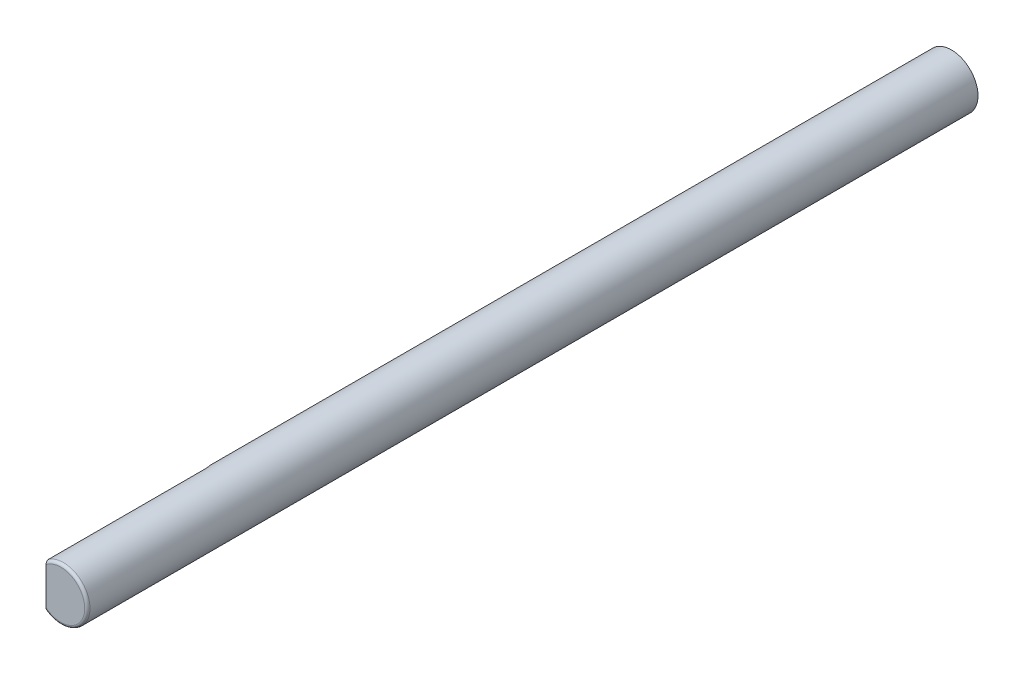
ISO-10303-21;
HEADER;
FILE_DESCRIPTION(('STEP AP214'),'2;1');
FILE_NAME('part.step','',(''),(''),'','','');
FILE_SCHEMA(('AUTOMOTIVE_DESIGN { 1 0 10303 214 1 1 1 1 }'));
ENDSEC;
DATA;
#1=APPLICATION_CONTEXT('core data for automotive mechanical design processes');
#2=APPLICATION_PROTOCOL_DEFINITION('international standard','automotive_design',2000,#1);
#3=PRODUCT_CONTEXT('',#1,'mechanical');
#4=PRODUCT('Part','Part','',(#3));
#5=PRODUCT_RELATED_PRODUCT_CATEGORY('part','',(#4));
#6=PRODUCT_DEFINITION_FORMATION('','',#4);
#7=PRODUCT_DEFINITION_CONTEXT('part definition',#1,'design');
#8=PRODUCT_DEFINITION('design','',#6,#7);
#9=PRODUCT_DEFINITION_SHAPE('','',#8);
#10=(LENGTH_UNIT() NAMED_UNIT(*) SI_UNIT(.MILLI.,.METRE.));
#11=(NAMED_UNIT(*) PLANE_ANGLE_UNIT() SI_UNIT($,.RADIAN.));
#12=(NAMED_UNIT(*) SI_UNIT($,.STERADIAN.) SOLID_ANGLE_UNIT());
#13=UNCERTAINTY_MEASURE_WITH_UNIT(LENGTH_MEASURE(1.E-05),#10,'distance_accuracy_value','');
#14=(GEOMETRIC_REPRESENTATION_CONTEXT(3) GLOBAL_UNCERTAINTY_ASSIGNED_CONTEXT((#13)) GLOBAL_UNIT_ASSIGNED_CONTEXT((#10,
#11,#12)) REPRESENTATION_CONTEXT('',''));
#15=CARTESIAN_POINT('',(0.,0.,0.));
#16=DIRECTION('',(0.,0.,1.));
#17=DIRECTION('',(1.,0.,0.));
#18=AXIS2_PLACEMENT_3D('',#15,#16,#17);
#19=CARTESIAN_POINT('',(0.,0.,84.));
#20=DIRECTION('',(0.,0.,-1.));
#21=DIRECTION('',(-1.,0.,0.));
#22=AXIS2_PLACEMENT_3D('',#19,#20,#21);
#23=CYLINDRICAL_SURFACE('',#22,2.5);
#24=CARTESIAN_POINT('',(0.,0.,0.));
#25=DIRECTION('',(0.,0.,1.));
#26=DIRECTION('',(1.,0.,0.));
#27=AXIS2_PLACEMENT_3D('',#24,#25,#26);
#28=CIRCLE('',#27,2.5);
#29=CARTESIAN_POINT('',(2.5,0.,0.));
#30=VERTEX_POINT('',#29);
#31=EDGE_CURVE('E67',#30,#30,#28,.T.);
#32=ORIENTED_EDGE('',*,*,#31,.T.);
#33=EDGE_LOOP('',(#32));
#34=FACE_BOUND('',#33,.T.);
#35=DIRECTION('',(0.,0.,-1.));
#36=VECTOR('',#35,1.);
#37=CARTESIAN_POINT('',(-1.4,2.0712315177208,84.));
#38=LINE('',#37,#36);
#39=CARTESIAN_POINT('',(-1.4,2.07123151772333,83.750000000001));
#40=VERTEX_POINT('',#39);
#41=CARTESIAN_POINT('',(-1.4,2.0712315177208,69.));
#42=VERTEX_POINT('',#41);
#43=EDGE_CURVE('E63',#40,#42,#38,.T.);
#44=ORIENTED_EDGE('',*,*,#43,.F.);
#45=CARTESIAN_POINT('',(0.,0.,83.75));
#46=DIRECTION('',(0.,0.,1.));
#47=DIRECTION('',(1.,0.,0.));
#48=AXIS2_PLACEMENT_3D('',#45,#46,#47);
#49=CIRCLE('',#48,2.5);
#50=CARTESIAN_POINT('',(-1.4,-2.07123151776407,83.7499999999845));
#51=VERTEX_POINT('',#50);
#52=EDGE_CURVE('E66',#40,#51,#49,.F.);
#53=ORIENTED_EDGE('',*,*,#52,.T.);
#54=DIRECTION('',(0.,0.,-1.));
#55=VECTOR('',#54,1.);
#56=CARTESIAN_POINT('',(-1.4,-2.0712315177208,84.));
#57=LINE('',#56,#55);
#58=CARTESIAN_POINT('',(-1.4,-2.0712315177208,69.));
#59=VERTEX_POINT('',#58);
#60=EDGE_CURVE('E43',#59,#51,#57,.F.);
#61=ORIENTED_EDGE('',*,*,#60,.F.);
#62=CARTESIAN_POINT('',(-1.4,2.0712315177208,69.));
#63=CARTESIAN_POINT('',(-1.39999849760734,2.071230026212,68.9761336321505));
#64=CARTESIAN_POINT('',(-1.4008551488557,2.07065376805563,68.9522791906795));
#65=CARTESIAN_POINT('',(-1.40426145306465,2.06834621400237,68.9047514836602));
#66=CARTESIAN_POINT('',(-1.40681083767712,2.06661510118376,68.8810781899964));
#67=CARTESIAN_POINT('',(-1.41693911021825,2.059697650857,68.8107243778242));
#68=CARTESIAN_POINT('',(-1.42699848417547,2.052787241238,68.7645353429884));
#69=CARTESIAN_POINT('',(-1.45316462908091,2.03434628246119,68.6749057138266));
#70=CARTESIAN_POINT('',(-1.46927177576742,2.0228154462408,68.6314652904634));
#71=CARTESIAN_POINT('',(-1.50660792862266,1.99516165480955,68.5484218227556));
#72=CARTESIAN_POINT('',(-1.52783743401127,1.97903825198415,68.5088191529622));
#73=CARTESIAN_POINT('',(-1.57474464069025,1.94192906346373,68.4334600120504));
#74=CARTESIAN_POINT('',(-1.60051004822204,1.92084396604998,68.3978075175362));
#75=CARTESIAN_POINT('',(-1.65476045746043,1.87431267599082,68.331833953011));
#76=CARTESIAN_POINT('',(-1.68324681285336,1.84886430753645,68.3015155582839));
#77=CARTESIAN_POINT('',(-1.75188020240658,1.78432861963461,68.2365263708325));
#78=CARTESIAN_POINT('',(-1.79259801470348,1.74359569054775,68.2040886147845));
#79=CARTESIAN_POINT('',(-1.87373293961663,1.6561127393503,68.1482480300484));
#80=CARTESIAN_POINT('',(-1.9141494387131,1.60935281202574,68.1248603339338));
#81=CARTESIAN_POINT('',(-2.00868395747665,1.49097224184156,68.0776682724385));
#82=CARTESIAN_POINT('',(-2.06167245566697,1.41698665412497,68.0575792205504));
#83=CARTESIAN_POINT('',(-2.15998693685785,1.26211622920362,68.0278654267815));
#84=CARTESIAN_POINT('',(-2.20529362558644,1.18121476547613,68.0182667137365));
#85=CARTESIAN_POINT('',(-2.27518682931121,1.03824044791976,68.0073850582776));
#86=CARTESIAN_POINT('',(-2.3020034371994,0.977346431713888,68.0045145279523));
#87=CARTESIAN_POINT('',(-2.35072392208404,0.853535355661818,68.0009151495136));
#88=CARTESIAN_POINT('',(-2.37262582697523,0.790617495251964,68.0001871597154));
#89=CARTESIAN_POINT('',(-2.41133776392088,0.663236816952995,67.9998771329302));
#90=CARTESIAN_POINT('',(-2.42814758959221,0.598773936558106,68.0002951423839));
#91=CARTESIAN_POINT('',(-2.45656795841086,0.46872501671509,68.0014998441395));
#92=CARTESIAN_POINT('',(-2.46817917835834,0.403139124625449,68.0022864884219));
#93=CARTESIAN_POINT('',(-2.48629500567455,0.270052532778325,68.0036879932044));
#94=CARTESIAN_POINT('',(-2.49270333079678,0.202538665641398,68.0042994849443));
#95=CARTESIAN_POINT('',(-2.50001501608926,0.0672084542153276,68.0050072591245));
#96=CARTESIAN_POINT('',(-2.50091820098299,-0.000607899635807313,68.0051035251607));
#97=CARTESIAN_POINT('',(-2.49721126667906,-0.136146726712124,68.0047344925744));
#98=CARTESIAN_POINT('',(-2.4925963955963,-0.203869068669604,68.0042687099395));
#99=CARTESIAN_POINT('',(-2.47787728559477,-0.338709390708671,68.0030098533241));
#100=CARTESIAN_POINT('',(-2.46777310584157,-0.405827377296271,68.0022167828711));
#101=CARTESIAN_POINT('',(-2.44166968941243,-0.541472802830017,68.0007798339144));
#102=CARTESIAN_POINT('',(-2.42546739083533,-0.60996134772772,68.000142511919));
#103=CARTESIAN_POINT('',(-2.38734056394478,-0.745353962722344,67.9998984993942));
#104=CARTESIAN_POINT('',(-2.36541438705108,-0.812257570263471,68.0002921060865));
#105=CARTESIAN_POINT('',(-2.31606035856292,-0.943815957062459,68.0032230416401));
#106=CARTESIAN_POINT('',(-2.288643687182,-1.00847499794695,68.0057560472638));
#107=CARTESIAN_POINT('',(-2.22858646003884,-1.13503422834247,68.0143345571866));
#108=CARTESIAN_POINT('',(-2.19595026735371,-1.19693666736589,68.0203771387836));
#109=CARTESIAN_POINT('',(-2.122180192478,-1.32373849224061,68.0385362468503));
#110=CARTESIAN_POINT('',(-2.08051081784005,-1.38825056412552,68.051233161495));
#111=CARTESIAN_POINT('',(-1.99267532777597,-1.51160369346608,68.0855058136959));
#112=CARTESIAN_POINT('',(-1.94651692208629,-1.57045414037392,68.1070665266446));
#113=CARTESIAN_POINT('',(-1.86164401332915,-1.66962592428561,68.156161196175));
#114=CARTESIAN_POINT('',(-1.82330783215959,-1.71128948965175,68.181610704844));
#115=CARTESIAN_POINT('',(-1.74725608089452,-1.78886384518241,68.2408954194401));
#116=CARTESIAN_POINT('',(-1.70953987270419,-1.82478093209195,68.2747213418162));
#117=CARTESIAN_POINT('',(-1.64313851742848,-1.88461329310625,68.3449408068653));
#118=CARTESIAN_POINT('',(-1.61398037683587,-1.90953027717284,68.3800297594055));
#119=CARTESIAN_POINT('',(-1.55957119801496,-1.9542205433493,68.4560692469223));
#120=CARTESIAN_POINT('',(-1.53431944251109,-1.97399477020797,68.4970187031508));
#121=CARTESIAN_POINT('',(-1.48925213542689,-2.00821755195406,68.5841221584053));
#122=CARTESIAN_POINT('',(-1.46946172497381,-2.0226415787411,68.6302988910753));
#123=CARTESIAN_POINT('',(-1.43683617139669,-2.04594939702088,68.7263564470342));
#124=CARTESIAN_POINT('',(-1.42399490317059,-2.05483806852325,68.7762339641375));
#125=CARTESIAN_POINT('',(-1.41007156402517,-2.06439648102775,68.85550440898));
#126=CARTESIAN_POINT('',(-1.40630111414533,-2.06696205385486,68.8842332109407));
#127=CARTESIAN_POINT('',(-1.40126460084139,-2.0703770393523,68.9419691555056));
#128=CARTESIAN_POINT('',(-1.39999499231638,-2.07122888138113,68.970975845446));
#129=CARTESIAN_POINT('',(-1.4,-2.0712315177208,69.));
#130=B_SPLINE_CURVE_WITH_KNOTS('',3,(#62,#63,#64,#65,#66,#67,#68,#69,#70,#71,#72,#73,#74,#75,
#76,#77,#78,#79,#80,#81,#82,#83,#84,#85,#86,#87,#88,#89,#90,#91,#92,#93,#94,#95,#96,#97,#98,#99,
#100,#101,#102,#103,#104,#105,#106,#107,#108,#109,#110,#111,#112,#113,#114,#115,#116,#117,#118,
#119,#120,#121,#122,#123,#124,#125,#126,#127,#128,#129),.UNSPECIFIED.,.F.,.F.,(4,2,2,2,2,2,2,2,
2,2,2,2,2,2,2,2,2,2,2,2,2,2,2,2,2,2,2,2,2,2,2,2,2,4),(0.,0.0715532695161541,0.143095198438069,
0.285662258223454,0.428238176934206,0.57082799656538,0.716559703502077,0.862364294176844,
1.05956506247232,1.25709415914806,1.53513154445075,1.81385724627246,2.01341483696889,
2.2130523608,2.41269797490278,2.61231758982236,2.81555207530803,3.01879303148233,
3.2222091351427,3.42562304636158,3.63651498052536,3.84746772251548,4.05799519420227,
4.2683475938554,4.50119263591325,4.73364461005268,4.91917153753062,5.10449375925448,
5.25978134170542,5.41504037691086,5.57100265153675,5.72682723330395,5.81394908507755,
5.90094734697911),.UNSPECIFIED.);
#131=EDGE_CURVE('E11',#42,#59,#130,.T.);
#132=ORIENTED_EDGE('',*,*,#131,.F.);
#133=EDGE_LOOP('',(#44,#53,#61,#132));
#134=FACE_BOUND('',#133,.T.);
#135=ADVANCED_FACE('F17',(#34,#134),#23,.T.);
#136=CARTESIAN_POINT('',(0.,0.,84.));
#137=DIRECTION('',(0.,0.,1.));
#138=DIRECTION('',(1.,0.,0.));
#139=AXIS2_PLACEMENT_3D('',#136,#137,#138);
#140=PLANE('',#139);
#141=CARTESIAN_POINT('',(0.,0.,84.));
#142=DIRECTION('',(0.,0.,1.));
#143=DIRECTION('',(1.,0.,0.));
#144=AXIS2_PLACEMENT_3D('',#141,#142,#143);
#145=CIRCLE('',#144,2.25);
#146=CARTESIAN_POINT('',(-1.4,-1.76139149538085,84.));
#147=VERTEX_POINT('',#146);
#148=CARTESIAN_POINT('',(-1.4,1.76139149538085,84.));
#149=VERTEX_POINT('',#148);
#150=EDGE_CURVE('E62',#147,#149,#145,.T.);
#151=ORIENTED_EDGE('',*,*,#150,.T.);
#152=DIRECTION('',(0.,-1.,0.));
#153=VECTOR('',#152,1.);
#154=CARTESIAN_POINT('',(-1.4,3.,84.));
#155=LINE('',#154,#153);
#156=EDGE_CURVE('E37',#149,#147,#155,.T.);
#157=ORIENTED_EDGE('',*,*,#156,.T.);
#158=EDGE_LOOP('',(#151,#157));
#159=FACE_BOUND('',#158,.T.);
#160=ADVANCED_FACE('F61',(#159),#140,.T.);
#161=CARTESIAN_POINT('',(0.,0.,83.75));
#162=DIRECTION('',(0.,0.,1.));
#163=DIRECTION('',(1.,0.,0.));
#164=AXIS2_PLACEMENT_3D('',#161,#162,#163);
#165=TOROIDAL_SURFACE('',#164,2.25,0.25);
#166=ORIENTED_EDGE('',*,*,#150,.F.);
#167=CARTESIAN_POINT('',(-1.4,-2.06751683308907,83.7891010855561));
#168=CARTESIAN_POINT('',(-1.4,-2.06974663483901,83.777437227729));
#169=CARTESIAN_POINT('',(-1.4,-2.07098619314722,83.7655748201244));
#170=CARTESIAN_POINT('',(-1.4,-2.07141107098375,83.7418068058583));
#171=CARTESIAN_POINT('',(-1.4,-2.07059465921011,83.7299011712248));
#172=CARTESIAN_POINT('',(-1.4,-2.0669532950407,83.7064217157143));
#173=CARTESIAN_POINT('',(-1.4,-2.06413145538078,83.6948474094905));
#174=CARTESIAN_POINT('',(-1.4,-2.0566281091433,83.6723235623699));
#175=CARTESIAN_POINT('',(-1.4,-2.05194655243663,83.6613740383232));
#176=CARTESIAN_POINT('',(-1.4,-2.04080930293354,83.6400952407117));
#177=CARTESIAN_POINT('',(-1.4,-2.03431462231287,83.6297865031043));
#178=CARTESIAN_POINT('',(-1.4,-2.01986653934911,83.6102529605718));
#179=CARTESIAN_POINT('',(-1.4,-2.01191266429024,83.6010285085018));
#180=CARTESIAN_POINT('',(-1.4,-1.9937541034437,83.5827007751038));
#181=CARTESIAN_POINT('',(-1.4,-1.98339275579103,83.5737531623327));
#182=CARTESIAN_POINT('',(-1.4,-1.96150965793689,83.5574182538762));
#183=CARTESIAN_POINT('',(-1.4,-1.94998725736353,83.5500318399631));
#184=CARTESIAN_POINT('',(-1.4,-1.92398558481914,83.5356647661989));
#185=CARTESIAN_POINT('',(-1.4,-1.90934196489993,83.5289819633223));
#186=CARTESIAN_POINT('',(-1.4,-1.87927037468484,83.5177232068366));
#187=CARTESIAN_POINT('',(-1.4,-1.86384195411895,83.5131484782001));
#188=CARTESIAN_POINT('',(-1.4,-1.82950833387279,83.50534262039));
#189=CARTESIAN_POINT('',(-1.4,-1.81050556367343,83.5025396438597));
#190=CARTESIAN_POINT('',(-1.4,-1.77229105082405,83.4996869685397));
#191=CARTESIAN_POINT('',(-1.4,-1.75307914527016,83.4996395965652));
#192=CARTESIAN_POINT('',(-1.4,-1.7117902214243,83.5024012227717));
#193=CARTESIAN_POINT('',(-1.4,-1.6897427077554,83.5056650155171));
#194=CARTESIAN_POINT('',(-1.4,-1.64644198331438,83.5156791685163));
#195=CARTESIAN_POINT('',(-1.4,-1.62518892017161,83.522430173364));
#196=CARTESIAN_POINT('',(-1.4,-1.58737690923002,83.5380971283731));
#197=CARTESIAN_POINT('',(-1.4,-1.57060656277229,83.5465031021878));
#198=CARTESIAN_POINT('',(-1.4,-1.53861329491591,83.5658770933205));
#199=CARTESIAN_POINT('',(-1.4,-1.52338802602703,83.57684113784));
#200=CARTESIAN_POINT('',(-1.4,-1.49897049299346,83.5981346111587));
#201=CARTESIAN_POINT('',(-1.4,-1.48925035998301,83.6078580040598));
#202=CARTESIAN_POINT('',(-1.4,-1.4714584706523,83.6287166431668));
#203=CARTESIAN_POINT('',(-1.4,-1.46338439491053,83.6398498664212));
#204=CARTESIAN_POINT('',(-1.4,-1.4507334316404,83.6611586976973));
#205=CARTESIAN_POINT('',(-1.4,-1.44578318431217,83.6711114792115));
#206=CARTESIAN_POINT('',(-1.4,-1.43759584646562,83.6917020970445));
#207=CARTESIAN_POINT('',(-1.4,-1.4343574653913,83.7023394104964));
#208=CARTESIAN_POINT('',(-1.4,-1.4298290781451,83.7240925513704));
#209=CARTESIAN_POINT('',(-1.4,-1.42855045587284,83.7352107917521));
#210=CARTESIAN_POINT('',(-1.4,-1.42809553098984,83.7574896787589));
#211=CARTESIAN_POINT('',(-1.4,-1.42891878834498,83.7686503160196));
#212=CARTESIAN_POINT('',(-1.4,-1.43241916211485,83.7896145408629));
#213=CARTESIAN_POINT('',(-1.4,-1.43491906611748,83.7994486210256));
#214=CARTESIAN_POINT('',(-1.4,-1.44141428492636,83.8186058830384));
#215=CARTESIAN_POINT('',(-1.4,-1.44541017890801,83.8279288654112));
#216=CARTESIAN_POINT('',(-1.4,-1.45621885548422,83.8488975046023));
#217=CARTESIAN_POINT('',(-1.4,-1.46352634537145,83.8602879919474));
#218=CARTESIAN_POINT('',(-1.4,-1.47989400527921,83.8817327842286));
#219=CARTESIAN_POINT('',(-1.4,-1.48895766474658,83.8917843605605));
#220=CARTESIAN_POINT('',(-1.4,-1.51172684638418,83.9137057431346));
#221=CARTESIAN_POINT('',(-1.4,-1.52596084061072,83.9250252168777));
#222=CARTESIAN_POINT('',(-1.4,-1.55604364818145,83.9452346300285));
#223=CARTESIAN_POINT('',(-1.4,-1.57189399103952,83.9541222383772));
#224=CARTESIAN_POINT('',(-1.4,-1.60509205177313,83.9697301689048));
#225=CARTESIAN_POINT('',(-1.4,-1.62246678945902,83.9763926027679));
#226=CARTESIAN_POINT('',(-1.4,-1.65795648623812,83.9872847058436));
#227=CARTESIAN_POINT('',(-1.4,-1.6760715609739,83.9915139934249));
#228=CARTESIAN_POINT('',(-1.4,-1.71668463073393,83.9981790966882));
#229=CARTESIAN_POINT('',(-1.4,-1.73928135435023,84.0000272604717));
#230=CARTESIAN_POINT('',(-1.4,-1.78448376970429,83.9999721482763));
#231=CARTESIAN_POINT('',(-1.4,-1.80708946223592,83.998068372268));
#232=CARTESIAN_POINT('',(-1.4,-1.84821950148282,83.990900479456));
#233=CARTESIAN_POINT('',(-1.4,-1.86684068119384,83.9861928771534));
#234=CARTESIAN_POINT('',(-1.4,-1.90306492013531,83.9738000651801));
#235=CARTESIAN_POINT('',(-1.4,-1.92066925601977,83.9661186867872));
#236=CARTESIAN_POINT('',(-1.4,-1.95108276070406,83.9494011757541));
#237=CARTESIAN_POINT('',(-1.4,-1.96417540630331,83.9408812900778));
#238=CARTESIAN_POINT('',(-1.4,-1.98879972897973,83.9218099295069));
#239=CARTESIAN_POINT('',(-1.4,-2.00033247871237,83.9112598628762));
#240=CARTESIAN_POINT('',(-1.4,-2.01971362853195,83.889999748638));
#241=CARTESIAN_POINT('',(-1.4,-2.02785558157892,83.8795574753407));
#242=CARTESIAN_POINT('',(-1.4,-2.0422844443968,83.8574712871667));
#243=CARTESIAN_POINT('',(-1.4,-2.0485750115816,83.8458298036274));
#244=CARTESIAN_POINT('',(-1.4,-2.05686313303344,83.8265667315097));
#245=CARTESIAN_POINT('',(-1.4,-2.05956520863061,83.8192420974961));
#246=CARTESIAN_POINT('',(-1.4,-2.06415970755473,83.8043406035764));
#247=CARTESIAN_POINT('',(-1.4,-2.06605195845041,83.7967636903238));
#248=CARTESIAN_POINT('',(-1.4,-2.06751683308907,83.7891010855561));
#249=B_SPLINE_CURVE_WITH_KNOTS('',3,(#167,#168,#169,#170,#171,#172,#173,#174,#175,#176,#177,
#178,#179,#180,#181,#182,#183,#184,#185,#186,#187,#188,#189,#190,#191,#192,#193,#194,#195,#196,
#197,#198,#199,#200,#201,#202,#203,#204,#205,#206,#207,#208,#209,#210,#211,#212,#213,#214,#215,
#216,#217,#218,#219,#220,#221,#222,#223,#224,#225,#226,#227,#228,#229,#230,#231,#232,#233,#234,
#235,#236,#237,#238,#239,#240,#241,#242,#243,#244,#245,#246,#247,#248),.UNSPECIFIED.,.T.,.F.,(4,
2,2,2,2,2,2,2,2,2,2,2,2,2,2,2,2,2,2,2,2,2,2,2,2,2,2,2,2,2,2,2,2,2,2,2,2,2,2,2,4),(0.,
0.0355961807103801,0.0712223464592027,0.106793335293122,0.142365283016314,0.178770448703504,
0.215187428979943,0.256102062954481,0.297039744316028,0.345150289814807,0.393288756539711,
0.450693683664056,0.508147082446449,0.574724248706875,0.641313725831208,0.697391627920788,
0.753383011517215,0.794490689246709,0.835540036524267,0.868754193931766,0.901943275733764,
0.93532442614022,0.968698588686508,0.999007499009383,1.02932815563991,1.06970492159057,
1.11016275306152,1.16442907958132,1.21874724217939,1.27438481822114,1.33003111846337,
1.39774216865079,1.46546224345024,1.52285865260922,1.58018135961871,1.62686222808655,
1.67351083167207,1.71307288751942,1.7525562556671,1.77593629271712,1.79932130546876),.UNSPECIFIED.);
#250=EDGE_CURVE('E30',#147,#51,#249,.T.);
#251=ORIENTED_EDGE('',*,*,#250,.T.);
#252=ORIENTED_EDGE('',*,*,#52,.F.);
#253=CARTESIAN_POINT('',(-1.4,1.42993276071515,83.7742261251652));
#254=CARTESIAN_POINT('',(-1.4,1.4284797737069,83.7635492828199));
#255=CARTESIAN_POINT('',(-1.4,1.42798224116026,83.752730889155));
#256=CARTESIAN_POINT('',(-1.4,1.42895217107645,83.7311692769836));
#257=CARTESIAN_POINT('',(-1.4,1.43042317296387,83.7204262288915));
#258=CARTESIAN_POINT('',(-1.4,1.43519728667231,83.6994144021854));
#259=CARTESIAN_POINT('',(-1.4,1.43849176524819,83.6891436338747));
#260=CARTESIAN_POINT('',(-1.4,1.44666971777003,83.6692642515512));
#261=CARTESIAN_POINT('',(-1.4,1.45155370771529,83.6596558537912));
#262=CARTESIAN_POINT('',(-1.4,1.46444756291549,83.6382390395022));
#263=CARTESIAN_POINT('',(-1.4,1.47295744431321,83.6267322484986));
#264=CARTESIAN_POINT('',(-1.4,1.49172277952782,83.6052419199731));
#265=CARTESIAN_POINT('',(-1.4,1.50198172658524,83.5952615081257));
#266=CARTESIAN_POINT('',(-1.4,1.5275223101756,83.57368243797));
#267=CARTESIAN_POINT('',(-1.4,1.54332172700824,83.5626978240926));
#268=CARTESIAN_POINT('',(-1.4,1.5764636907251,83.5434107210859));
#269=CARTESIAN_POINT('',(-1.4,1.59380751652582,83.5351104817155));
#270=CARTESIAN_POINT('',(-1.4,1.62990007353498,83.5209669260947));
#271=CARTESIAN_POINT('',(-1.4,1.64867116870904,83.5151810264129));
#272=CARTESIAN_POINT('',(-1.4,1.68684132045745,83.5063189232525));
#273=CARTESIAN_POINT('',(-1.4,1.70624056049469,83.5032435189687));
#274=CARTESIAN_POINT('',(-1.4,1.74873438637282,83.4995536950047));
#275=CARTESIAN_POINT('',(-1.4,1.77187720679287,83.4994690666402));
#276=CARTESIAN_POINT('',(-1.4,1.81784027375452,83.5033042850002));
#277=CARTESIAN_POINT('',(-1.4,1.8406606502949,83.5072224683455));
#278=CARTESIAN_POINT('',(-1.4,1.88030824440976,83.5179758414875));
#279=CARTESIAN_POINT('',(-1.4,1.89735869050308,83.5239903626366));
#280=CARTESIAN_POINT('',(-1.4,1.93025269881234,83.5387117960323));
#281=CARTESIAN_POINT('',(-1.4,1.94609799374124,83.5474147481545));
#282=CARTESIAN_POINT('',(-1.4,1.97329805283162,83.5657532706061));
#283=CARTESIAN_POINT('',(-1.4,1.98495007952567,83.5749470568571));
#284=CARTESIAN_POINT('',(-1.4,2.00659791928444,83.5951300283886));
#285=CARTESIAN_POINT('',(-1.4,2.01659399192529,83.6061189317414));
#286=CARTESIAN_POINT('',(-1.4,2.03452337916375,83.6298236204108));
#287=CARTESIAN_POINT('',(-1.4,2.04243949530355,83.64255255701));
#288=CARTESIAN_POINT('',(-1.4,2.05560314677401,83.6693255902568));
#289=CARTESIAN_POINT('',(-1.4,2.06085347256681,83.6833682933797));
#290=CARTESIAN_POINT('',(-1.4,2.06777488493683,83.7101941879195));
#291=CARTESIAN_POINT('',(-1.4,2.06984728297949,83.7228744694489));
#292=CARTESIAN_POINT('',(-1.4,2.07161875211616,83.7483975931196));
#293=CARTESIAN_POINT('',(-1.4,2.0713191453306,83.7612403407195));
#294=CARTESIAN_POINT('',(-1.4,2.06849276478409,83.7855836680409));
#295=CARTESIAN_POINT('',(-1.4,2.06615414494294,83.7971067418848));
#296=CARTESIAN_POINT('',(-1.4,2.05962450786554,83.8196121664179));
#297=CARTESIAN_POINT('',(-1.4,2.05543347758694,83.8305945132994));
#298=CARTESIAN_POINT('',(-1.4,2.04525546888174,83.8520540796839));
#299=CARTESIAN_POINT('',(-1.4,2.03922285619763,83.8625095152223));
#300=CARTESIAN_POINT('',(-1.4,2.02565875048042,83.8823937703506));
#301=CARTESIAN_POINT('',(-1.4,2.01812673296544,83.8918222289203));
#302=CARTESIAN_POINT('',(-1.4,2.00089325345193,83.9105442717815));
#303=CARTESIAN_POINT('',(-1.4,1.99104234333876,83.9196998594455));
#304=CARTESIAN_POINT('',(-1.4,1.97014066575349,83.9365135536256));
#305=CARTESIAN_POINT('',(-1.4,1.95908926581928,83.9441708647857));
#306=CARTESIAN_POINT('',(-1.4,1.93412074607394,83.9591496788247));
#307=CARTESIAN_POINT('',(-1.4,1.92003619338562,83.9661916355392));
#308=CARTESIAN_POINT('',(-1.4,1.89102703340341,83.9782429473955));
#309=CARTESIAN_POINT('',(-1.4,1.87610193650406,83.9832511036366));
#310=CARTESIAN_POINT('',(-1.4,1.84280444408958,83.9920802029753));
#311=CARTESIAN_POINT('',(-1.4,1.82432193698389,83.9954864482576));
#312=CARTESIAN_POINT('',(-1.4,1.78705897675403,83.999632953357));
#313=CARTESIAN_POINT('',(-1.4,1.7682783040645,84.0003711473871));
#314=CARTESIAN_POINT('',(-1.4,1.72766042914337,83.9991943088168));
#315=CARTESIAN_POINT('',(-1.4,1.7058358179539,83.9968162703746));
#316=CARTESIAN_POINT('',(-1.4,1.66281719964284,83.9886666111979));
#317=CARTESIAN_POINT('',(-1.4,1.64162346661544,83.982893537413));
#318=CARTESIAN_POINT('',(-1.4,1.60269978366878,83.9687692719743));
#319=CARTESIAN_POINT('',(-1.4,1.58484363630791,83.9607661895332));
#320=CARTESIAN_POINT('',(-1.4,1.55064348794346,83.9419985160101));
#321=CARTESIAN_POINT('',(-1.4,1.53429726285777,83.9312380776336));
#322=CARTESIAN_POINT('',(-1.4,1.50800360075094,83.9101738541302));
#323=CARTESIAN_POINT('',(-1.4,1.49752252074508,83.9005364541875));
#324=CARTESIAN_POINT('',(-1.4,1.47819000882463,83.8797316327081));
#325=CARTESIAN_POINT('',(-1.4,1.46933696054252,83.8685657481343));
#326=CARTESIAN_POINT('',(-1.4,1.45538663981269,83.847216926786));
#327=CARTESIAN_POINT('',(-1.4,1.44989176924673,83.8372946061366));
#328=CARTESIAN_POINT('',(-1.4,1.44061366998302,83.8166963128793));
#329=CARTESIAN_POINT('',(-1.4,1.4368251810474,83.8060227753252));
#330=CARTESIAN_POINT('',(-1.4,1.43226142431139,83.7882300777324));
#331=CARTESIAN_POINT('',(-1.4,1.43088982249655,83.7812588086626));
#332=CARTESIAN_POINT('',(-1.4,1.42993276071515,83.7742261251652));
#333=B_SPLINE_CURVE_WITH_KNOTS('',3,(#253,#254,#255,#256,#257,#258,#259,#260,#261,#262,#263,
#264,#265,#266,#267,#268,#269,#270,#271,#272,#273,#274,#275,#276,#277,#278,#279,#280,#281,#282,
#283,#284,#285,#286,#287,#288,#289,#290,#291,#292,#293,#294,#295,#296,#297,#298,#299,#300,#301,
#302,#303,#304,#305,#306,#307,#308,#309,#310,#311,#312,#313,#314,#315,#316,#317,#318,#319,#320,
#321,#322,#323,#324,#325,#326,#327,#328,#329,#330,#331,#332),.UNSPECIFIED.,.T.,.F.,(4,2,2,2,2,2,
2,2,2,2,2,2,2,2,2,2,2,2,2,2,2,2,2,2,2,2,2,2,2,2,2,2,2,2,2,2,2,2,2,4),(0.,0.0322996316278755,
0.0646574160847315,0.0968632971569159,0.129079643593774,0.171780181848116,0.214567022800653,
0.271988079145382,0.329457135780454,0.388177203968057,0.446914580092213,0.516012838432108,
0.585082394481391,0.639116393508119,0.693071175643663,0.737421555445746,0.781764976590856,
0.826464275056213,0.871116686793251,0.909451369851505,0.947764687229092,0.982877218288148,
1.01798999656939,1.05405527119205,1.09013318344647,1.13032537842213,1.17053885177048,
1.21760450329622,1.26469785931716,1.32086538782001,1.37707639573949,1.44266164389506,
1.50827498250893,1.56676205830018,1.62516156230652,1.66773609512109,1.71026812749148,
1.74416592260338,1.777958494037,1.79923379987859),.UNSPECIFIED.);
#334=EDGE_CURVE('E58',#40,#149,#333,.T.);
#335=ORIENTED_EDGE('',*,*,#334,.T.);
#336=EDGE_LOOP('',(#166,#251,#252,#335));
#337=FACE_BOUND('',#336,.T.);
#338=ADVANCED_FACE('F19',(#337),#165,.T.);
#339=CARTESIAN_POINT('',(0.,0.,0.));
#340=DIRECTION('',(0.,0.,1.));
#341=DIRECTION('',(1.,0.,0.));
#342=AXIS2_PLACEMENT_3D('',#339,#340,#341);
#343=PLANE('',#342);
#344=ORIENTED_EDGE('',*,*,#31,.F.);
#345=EDGE_LOOP('',(#344));
#346=FACE_BOUND('',#345,.T.);
#347=ADVANCED_FACE('F87',(#346),#343,.F.);
#348=CARTESIAN_POINT('',(-2.4,3.,69.));
#349=DIRECTION('',(0.,-1.,0.));
#350=DIRECTION('',(0.,0.,-1.));
#351=AXIS2_PLACEMENT_3D('',#348,#349,#350);
#352=CYLINDRICAL_SURFACE('',#351,1.);
#353=ORIENTED_EDGE('',*,*,#131,.T.);
#354=DIRECTION('',(0.,-1.,0.));
#355=VECTOR('',#354,1.);
#356=CARTESIAN_POINT('',(-1.4,3.,69.));
#357=LINE('',#356,#355);
#358=EDGE_CURVE('E64',#42,#59,#357,.T.);
#359=ORIENTED_EDGE('',*,*,#358,.F.);
#360=EDGE_LOOP('',(#353,#359));
#361=FACE_BOUND('',#360,.T.);
#362=ADVANCED_FACE('F82',(#361),#352,.F.);
#363=CARTESIAN_POINT('',(-1.4,3.,84.));
#364=DIRECTION('',(-1.,0.,0.));
#365=DIRECTION('',(0.,0.,1.));
#366=AXIS2_PLACEMENT_3D('',#363,#364,#365);
#367=PLANE('',#366);
#368=ORIENTED_EDGE('',*,*,#60,.T.);
#369=ORIENTED_EDGE('',*,*,#250,.F.);
#370=ORIENTED_EDGE('',*,*,#156,.F.);
#371=ORIENTED_EDGE('',*,*,#334,.F.);
#372=ORIENTED_EDGE('',*,*,#43,.T.);
#373=ORIENTED_EDGE('',*,*,#358,.T.);
#374=EDGE_LOOP('',(#368,#369,#370,#371,#372,#373));
#375=FACE_BOUND('',#374,.T.);
#376=ADVANCED_FACE('F53',(#375),#367,.T.);
#377=CLOSED_SHELL('',(#135,#160,#338,#347,#362,#376));
#378=MANIFOLD_SOLID_BREP('B1',#377);
#379=ADVANCED_BREP_SHAPE_REPRESENTATION('',(#18,#378),#14);
#380=SHAPE_DEFINITION_REPRESENTATION(#9,#379);
ENDSEC;
END-ISO-10303-21;
